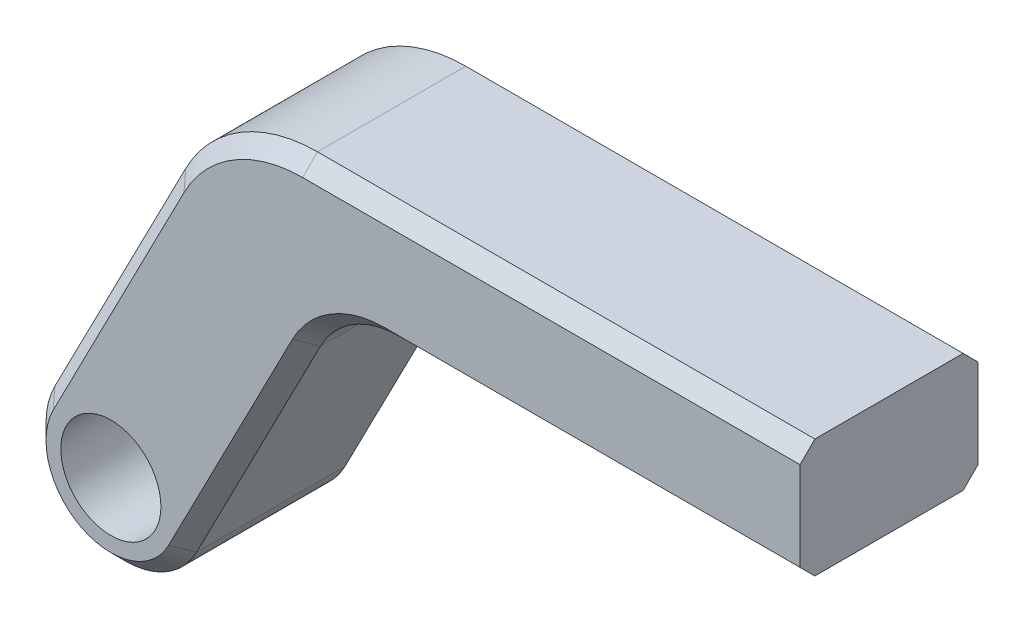
ISO-10303-21;
HEADER;
FILE_DESCRIPTION(('STEP AP214'),'2;1');
FILE_NAME('part.step','',(''),(''),'','','');
FILE_SCHEMA(('AUTOMOTIVE_DESIGN { 1 0 10303 214 1 1 1 1 }'));
ENDSEC;
DATA;
#1=APPLICATION_CONTEXT('core data for automotive mechanical design processes');
#2=APPLICATION_PROTOCOL_DEFINITION('international standard','automotive_design',2000,#1);
#3=PRODUCT_CONTEXT('',#1,'mechanical');
#4=PRODUCT('Part','Part','',(#3));
#5=PRODUCT_RELATED_PRODUCT_CATEGORY('part','',(#4));
#6=PRODUCT_DEFINITION_FORMATION('','',#4);
#7=PRODUCT_DEFINITION_CONTEXT('part definition',#1,'design');
#8=PRODUCT_DEFINITION('design','',#6,#7);
#9=PRODUCT_DEFINITION_SHAPE('','',#8);
#10=(LENGTH_UNIT() NAMED_UNIT(*) SI_UNIT(.MILLI.,.METRE.));
#11=(NAMED_UNIT(*) PLANE_ANGLE_UNIT() SI_UNIT($,.RADIAN.));
#12=(NAMED_UNIT(*) SI_UNIT($,.STERADIAN.) SOLID_ANGLE_UNIT());
#13=UNCERTAINTY_MEASURE_WITH_UNIT(LENGTH_MEASURE(1.E-05),#10,'distance_accuracy_value','');
#14=(GEOMETRIC_REPRESENTATION_CONTEXT(3) GLOBAL_UNCERTAINTY_ASSIGNED_CONTEXT((#13)) GLOBAL_UNIT_ASSIGNED_CONTEXT((#10,
#11,#12)) REPRESENTATION_CONTEXT('',''));
#15=CARTESIAN_POINT('',(0.,0.,0.));
#16=DIRECTION('',(0.,0.,1.));
#17=DIRECTION('',(1.,0.,0.));
#18=AXIS2_PLACEMENT_3D('',#15,#16,#17);
#19=CARTESIAN_POINT('',(-4.7779354520384,2.46210434712963,12.));
#20=DIRECTION('',(0.888918223635052,-0.458065925047372,0.));
#21=DIRECTION('',(0.458065925047372,0.888918223635052,0.));
#22=AXIS2_PLACEMENT_3D('',#19,#20,#21);
#23=PLANE('',#22);
#24=DIRECTION('',(0.,0.,-1.));
#25=VECTOR('',#24,1.);
#26=CARTESIAN_POINT('',(4.04337845376568,19.5806592504737,0.));
#27=LINE('',#26,#25);
#28=CARTESIAN_POINT('',(4.04337845376568,19.5806592504737,11.));
#29=VERTEX_POINT('',#28);
#30=CARTESIAN_POINT('',(4.04337845376568,19.5806592504737,1.));
#31=VERTEX_POINT('',#30);
#32=EDGE_CURVE('E336',#29,#31,#27,.T.);
#33=ORIENTED_EDGE('',*,*,#32,.T.);
#34=DIRECTION('',(-0.458065925047372,-0.888918223635052,0.));
#35=VECTOR('',#34,1.);
#36=CARTESIAN_POINT('',(-4.7779354520384,2.46210434712963,1.));
#37=LINE('',#36,#35);
#38=CARTESIAN_POINT('',(-4.7779354520384,2.46210434712962,1.));
#39=VERTEX_POINT('',#38);
#40=EDGE_CURVE('E218',#31,#39,#37,.T.);
#41=ORIENTED_EDGE('',*,*,#40,.T.);
#42=DIRECTION('',(0.,0.,-1.));
#43=VECTOR('',#42,1.);
#44=CARTESIAN_POINT('',(-4.7779354520384,2.46210434712962,12.));
#45=LINE('',#44,#43);
#46=CARTESIAN_POINT('',(-4.7779354520384,2.46210434712962,11.));
#47=VERTEX_POINT('',#46);
#48=EDGE_CURVE('E324',#47,#39,#45,.T.);
#49=ORIENTED_EDGE('',*,*,#48,.F.);
#50=DIRECTION('',(0.458065925047372,0.888918223635052,0.));
#51=VECTOR('',#50,1.);
#52=CARTESIAN_POINT('',(4.04337845376568,19.5806592504737,11.));
#53=LINE('',#52,#51);
#54=EDGE_CURVE('E215',#47,#29,#53,.T.);
#55=ORIENTED_EDGE('',*,*,#54,.T.);
#56=EDGE_LOOP('',(#33,#41,#49,#55));
#57=FACE_BOUND('',#56,.T.);
#58=ADVANCED_FACE('F43',(#57),#23,.F.);
#59=CARTESIAN_POINT('',(0.,0.,12.));
#60=DIRECTION('',(0.,0.,-1.));
#61=DIRECTION('',(-1.,0.,0.));
#62=AXIS2_PLACEMENT_3D('',#59,#60,#61);
#63=CYLINDRICAL_SURFACE('',#62,5.375);
#64=ORIENTED_EDGE('',*,*,#48,.T.);
#65=CARTESIAN_POINT('',(0.,0.,1.));
#66=DIRECTION('',(0.,0.,1.));
#67=DIRECTION('',(1.,0.,0.));
#68=AXIS2_PLACEMENT_3D('',#65,#66,#67);
#69=CIRCLE('',#68,5.375);
#70=CARTESIAN_POINT('',(4.7779354520384,-2.46210434712962,1.));
#71=VERTEX_POINT('',#70);
#72=EDGE_CURVE('E212',#39,#71,#69,.T.);
#73=ORIENTED_EDGE('',*,*,#72,.T.);
#74=DIRECTION('',(0.,0.,-1.));
#75=VECTOR('',#74,1.);
#76=CARTESIAN_POINT('',(4.7779354520384,-2.46210434712962,12.));
#77=LINE('',#76,#75);
#78=CARTESIAN_POINT('',(4.7779354520384,-2.46210434712962,11.));
#79=VERTEX_POINT('',#78);
#80=EDGE_CURVE('E314',#79,#71,#77,.T.);
#81=ORIENTED_EDGE('',*,*,#80,.F.);
#82=CARTESIAN_POINT('',(0.,0.,11.));
#83=DIRECTION('',(0.,0.,1.));
#84=DIRECTION('',(1.,0.,0.));
#85=AXIS2_PLACEMENT_3D('',#82,#83,#84);
#86=CIRCLE('',#85,5.375);
#87=EDGE_CURVE('E209',#79,#47,#86,.F.);
#88=ORIENTED_EDGE('',*,*,#87,.T.);
#89=EDGE_LOOP('',(#64,#73,#81,#88));
#90=FACE_BOUND('',#89,.T.);
#91=ADVANCED_FACE('F423',(#90),#63,.T.);
#92=CARTESIAN_POINT('',(4.7779354520384,-2.46210434712962,12.));
#93=DIRECTION('',(0.888918223635051,-0.458065925047372,0.));
#94=DIRECTION('',(0.458065925047372,0.888918223635052,0.));
#95=AXIS2_PLACEMENT_3D('',#92,#93,#94);
#96=PLANE('',#95);
#97=ORIENTED_EDGE('',*,*,#80,.T.);
#98=DIRECTION('',(0.458065925047372,0.888918223635052,0.));
#99=VECTOR('',#98,1.);
#100=CARTESIAN_POINT('',(13.1313221118643,13.7483955502842,1.));
#101=LINE('',#100,#99);
#102=CARTESIAN_POINT('',(13.1313221118643,13.7483955502842,1.));
#103=VERTEX_POINT('',#102);
#104=EDGE_CURVE('E206',#71,#103,#101,.T.);
#105=ORIENTED_EDGE('',*,*,#104,.T.);
#106=DIRECTION('',(0.,0.,-1.));
#107=VECTOR('',#106,1.);
#108=CARTESIAN_POINT('',(13.1313221118643,13.7483955502842,12.));
#109=LINE('',#108,#107);
#110=CARTESIAN_POINT('',(13.1313221118643,13.7483955502842,11.));
#111=VERTEX_POINT('',#110);
#112=EDGE_CURVE('E332',#103,#111,#109,.F.);
#113=ORIENTED_EDGE('',*,*,#112,.T.);
#114=DIRECTION('',(-0.458065925047372,-0.888918223635052,0.));
#115=VECTOR('',#114,1.);
#116=CARTESIAN_POINT('',(4.7779354520384,-2.46210434712962,11.));
#117=LINE('',#116,#115);
#118=EDGE_CURVE('E203',#111,#79,#117,.T.);
#119=ORIENTED_EDGE('',*,*,#118,.T.);
#120=EDGE_LOOP('',(#97,#105,#113,#119));
#121=FACE_BOUND('',#120,.T.);
#122=ADVANCED_FACE('F393',(#121),#96,.T.);
#123=CARTESIAN_POINT('',(0.,17.,12.));
#124=DIRECTION('',(0.,-1.,0.));
#125=DIRECTION('',(1.,0.,0.));
#126=AXIS2_PLACEMENT_3D('',#123,#124,#125);
#127=PLANE('',#126);
#128=DIRECTION('',(0.,0.,-1.));
#129=VECTOR('',#128,1.);
#130=CARTESIAN_POINT('',(18.4648314536746,17.,0.));
#131=LINE('',#130,#129);
#132=CARTESIAN_POINT('',(18.4648314536746,17.,11.));
#133=VERTEX_POINT('',#132);
#134=CARTESIAN_POINT('',(18.4648314536746,17.,1.));
#135=VERTEX_POINT('',#134);
#136=EDGE_CURVE('E328',#133,#135,#131,.T.);
#137=ORIENTED_EDGE('',*,*,#136,.T.);
#138=DIRECTION('',(1.,0.,0.));
#139=VECTOR('',#138,1.);
#140=CARTESIAN_POINT('',(46.4739345166854,17.,1.));
#141=LINE('',#140,#139);
#142=CARTESIAN_POINT('',(46.4739345166854,17.,1.));
#143=VERTEX_POINT('',#142);
#144=EDGE_CURVE('E363',#135,#143,#141,.T.);
#145=ORIENTED_EDGE('',*,*,#144,.T.);
#146=DIRECTION('',(0.,0.,-1.));
#147=VECTOR('',#146,1.);
#148=CARTESIAN_POINT('',(46.4739345166854,17.,12.));
#149=LINE('',#148,#147);
#150=CARTESIAN_POINT('',(46.4739345166854,17.,11.));
#151=VERTEX_POINT('',#150);
#152=EDGE_CURVE('E309',#151,#143,#149,.T.);
#153=ORIENTED_EDGE('',*,*,#152,.F.);
#154=DIRECTION('',(-1.,0.,0.));
#155=VECTOR('',#154,1.);
#156=CARTESIAN_POINT('',(0.,17.,11.));
#157=LINE('',#156,#155);
#158=EDGE_CURVE('E359',#151,#133,#157,.T.);
#159=ORIENTED_EDGE('',*,*,#158,.T.);
#160=EDGE_LOOP('',(#137,#145,#153,#159));
#161=FACE_BOUND('',#160,.T.);
#162=ADVANCED_FACE('F369',(#161),#127,.T.);
#163=CARTESIAN_POINT('',(46.4739345166854,0.,12.));
#164=DIRECTION('',(1.,0.,0.));
#165=DIRECTION('',(0.,0.,-1.));
#166=AXIS2_PLACEMENT_3D('',#163,#164,#165);
#167=PLANE('',#166);
#168=ORIENTED_EDGE('',*,*,#152,.T.);
#169=DIRECTION('',(0.,0.707106781186548,-0.707106781186548));
#170=VECTOR('',#169,1.);
#171=CARTESIAN_POINT('',(46.4739345166854,3.,15.));
#172=LINE('',#171,#170);
#173=CARTESIAN_POINT('',(46.4739345166854,18.,0.));
#174=VERTEX_POINT('',#173);
#175=EDGE_CURVE('E179',#143,#174,#172,.T.);
#176=ORIENTED_EDGE('',*,*,#175,.T.);
#177=DIRECTION('',(0.,-1.,0.));
#178=VECTOR('',#177,1.);
#179=CARTESIAN_POINT('',(46.4739345166854,0.,0.));
#180=LINE('',#179,#178);
#181=CARTESIAN_POINT('',(46.4739345166854,24.,0.));
#182=VERTEX_POINT('',#181);
#183=EDGE_CURVE('E161',#182,#174,#180,.T.);
#184=ORIENTED_EDGE('',*,*,#183,.F.);
#185=DIRECTION('',(0.,0.707106781186548,0.707106781186548));
#186=VECTOR('',#185,1.);
#187=CARTESIAN_POINT('',(46.4739345166854,18.,-6.));
#188=LINE('',#187,#186);
#189=CARTESIAN_POINT('',(46.4739345166854,25.,1.));
#190=VERTEX_POINT('',#189);
#191=EDGE_CURVE('E176',#182,#190,#188,.T.);
#192=ORIENTED_EDGE('',*,*,#191,.T.);
#193=DIRECTION('',(0.,0.,-1.));
#194=VECTOR('',#193,1.);
#195=CARTESIAN_POINT('',(46.4739345166854,25.,12.));
#196=LINE('',#195,#194);
#197=CARTESIAN_POINT('',(46.4739345166854,25.,11.));
#198=VERTEX_POINT('',#197);
#199=EDGE_CURVE('E304',#198,#190,#196,.T.);
#200=ORIENTED_EDGE('',*,*,#199,.F.);
#201=DIRECTION('',(0.,0.707106781186548,-0.707106781186548));
#202=VECTOR('',#201,1.);
#203=CARTESIAN_POINT('',(46.4739345166854,12.,24.));
#204=LINE('',#203,#202);
#205=CARTESIAN_POINT('',(46.4739345166854,24.,12.));
#206=VERTEX_POINT('',#205);
#207=EDGE_CURVE('E194',#198,#206,#204,.F.);
#208=ORIENTED_EDGE('',*,*,#207,.T.);
#209=DIRECTION('',(0.,-1.,0.));
#210=VECTOR('',#209,1.);
#211=CARTESIAN_POINT('',(46.4739345166854,0.,12.));
#212=LINE('',#211,#210);
#213=CARTESIAN_POINT('',(46.4739345166854,18.,12.));
#214=VERTEX_POINT('',#213);
#215=EDGE_CURVE('E317',#206,#214,#212,.T.);
#216=ORIENTED_EDGE('',*,*,#215,.T.);
#217=DIRECTION('',(0.,0.707106781186548,0.707106781186548));
#218=VECTOR('',#217,1.);
#219=CARTESIAN_POINT('',(46.4739345166854,9.00000000000001,2.99999999999999));
#220=LINE('',#219,#218);
#221=EDGE_CURVE('E188',#214,#151,#220,.F.);
#222=ORIENTED_EDGE('',*,*,#221,.T.);
#223=EDGE_LOOP('',(#168,#176,#184,#192,#200,#208,#216,#222));
#224=FACE_BOUND('',#223,.T.);
#225=ADVANCED_FACE('F174',(#224),#167,.T.);
#226=CARTESIAN_POINT('',(0.,25.,12.));
#227=DIRECTION('',(0.,1.,0.));
#228=DIRECTION('',(0.,0.,1.));
#229=AXIS2_PLACEMENT_3D('',#226,#227,#228);
#230=PLANE('',#229);
#231=ORIENTED_EDGE('',*,*,#199,.T.);
#232=DIRECTION('',(-1.,0.,0.));
#233=VECTOR('',#232,1.);
#234=CARTESIAN_POINT('',(12.9325606901162,25.,1.));
#235=LINE('',#234,#233);
#236=CARTESIAN_POINT('',(12.9325606901162,25.,1.));
#237=VERTEX_POINT('',#236);
#238=EDGE_CURVE('E186',#190,#237,#235,.T.);
#239=ORIENTED_EDGE('',*,*,#238,.T.);
#240=DIRECTION('',(0.,0.,-1.));
#241=VECTOR('',#240,1.);
#242=CARTESIAN_POINT('',(12.9325606901162,25.,12.));
#243=LINE('',#242,#241);
#244=CARTESIAN_POINT('',(12.9325606901162,25.,11.));
#245=VERTEX_POINT('',#244);
#246=EDGE_CURVE('E170',#237,#245,#243,.F.);
#247=ORIENTED_EDGE('',*,*,#246,.T.);
#248=DIRECTION('',(1.,0.,0.));
#249=VECTOR('',#248,1.);
#250=CARTESIAN_POINT('',(0.,25.,11.));
#251=LINE('',#250,#249);
#252=EDGE_CURVE('E227',#245,#198,#251,.T.);
#253=ORIENTED_EDGE('',*,*,#252,.T.);
#254=EDGE_LOOP('',(#231,#239,#247,#253));
#255=FACE_BOUND('',#254,.T.);
#256=ADVANCED_FACE('F303',(#255),#230,.T.);
#257=CARTESIAN_POINT('',(0.,0.,12.));
#258=DIRECTION('',(0.,0.,-1.));
#259=DIRECTION('',(-1.,0.,0.));
#260=AXIS2_PLACEMENT_3D('',#257,#258,#259);
#261=CYLINDRICAL_SURFACE('',#260,3.375);
#262=CARTESIAN_POINT('',(0.,0.,12.));
#263=DIRECTION('',(0.,0.,1.));
#264=DIRECTION('',(1.,0.,0.));
#265=AXIS2_PLACEMENT_3D('',#262,#263,#264);
#266=CIRCLE('',#265,3.375);
#267=CARTESIAN_POINT('',(3.375,0.,12.));
#268=VERTEX_POINT('',#267);
#269=EDGE_CURVE('E310',#268,#268,#266,.T.);
#270=ORIENTED_EDGE('',*,*,#269,.T.);
#271=EDGE_LOOP('',(#270));
#272=FACE_BOUND('',#271,.T.);
#273=CARTESIAN_POINT('',(0.,0.,0.));
#274=DIRECTION('',(0.,0.,1.));
#275=DIRECTION('',(1.,0.,0.));
#276=AXIS2_PLACEMENT_3D('',#273,#274,#275);
#277=CIRCLE('',#276,3.375);
#278=CARTESIAN_POINT('',(3.375,0.,0.));
#279=VERTEX_POINT('',#278);
#280=EDGE_CURVE('E181',#279,#279,#277,.T.);
#281=ORIENTED_EDGE('',*,*,#280,.F.);
#282=EDGE_LOOP('',(#281));
#283=FACE_BOUND('',#282,.T.);
#284=ADVANCED_FACE('F411',(#272,#283),#261,.F.);
#285=CARTESIAN_POINT('',(0.,0.,12.));
#286=DIRECTION('',(0.,0.,1.));
#287=DIRECTION('',(1.,0.,0.));
#288=AXIS2_PLACEMENT_3D('',#285,#286,#287);
#289=PLANE('',#288);
#290=CARTESIAN_POINT('',(18.4648314536746,11.,12.));
#291=DIRECTION('',(0.,0.,1.));
#292=DIRECTION('',(1.,0.,0.));
#293=AXIS2_PLACEMENT_3D('',#290,#291,#292);
#294=CIRCLE('',#293,7.00000000000001);
#295=CARTESIAN_POINT('',(12.2424038882293,14.2064614753316,12.));
#296=VERTEX_POINT('',#295);
#297=CARTESIAN_POINT('',(18.4648314536746,18.,12.));
#298=VERTEX_POINT('',#297);
#299=EDGE_CURVE('E53',#296,#298,#294,.F.);
#300=ORIENTED_EDGE('',*,*,#299,.T.);
#301=DIRECTION('',(1.,0.,0.));
#302=VECTOR('',#301,1.);
#303=CARTESIAN_POINT('',(0.,18.,12.));
#304=LINE('',#303,#302);
#305=EDGE_CURVE('E12',#298,#214,#304,.T.);
#306=ORIENTED_EDGE('',*,*,#305,.T.);
#307=ORIENTED_EDGE('',*,*,#215,.F.);
#308=DIRECTION('',(-1.,0.,0.));
#309=VECTOR('',#308,1.);
#310=CARTESIAN_POINT('',(0.,24.,12.));
#311=LINE('',#310,#309);
#312=CARTESIAN_POINT('',(12.9325606901162,24.,12.));
#313=VERTEX_POINT('',#312);
#314=EDGE_CURVE('E232',#206,#313,#311,.T.);
#315=ORIENTED_EDGE('',*,*,#314,.T.);
#316=CARTESIAN_POINT('',(12.9325606901162,15.,12.));
#317=DIRECTION('',(0.,0.,1.));
#318=DIRECTION('',(1.,0.,0.));
#319=AXIS2_PLACEMENT_3D('',#316,#317,#318);
#320=CIRCLE('',#319,8.99999999999999);
#321=CARTESIAN_POINT('',(4.93229667740073,19.1225933254263,12.));
#322=VERTEX_POINT('',#321);
#323=EDGE_CURVE('E235',#313,#322,#320,.T.);
#324=ORIENTED_EDGE('',*,*,#323,.T.);
#325=DIRECTION('',(-0.458065925047372,-0.888918223635051,0.));
#326=VECTOR('',#325,1.);
#327=CARTESIAN_POINT('',(-3.88901722840334,2.00403842208225,12.));
#328=LINE('',#327,#326);
#329=CARTESIAN_POINT('',(-3.88901722840334,2.00403842208225,12.));
#330=VERTEX_POINT('',#329);
#331=EDGE_CURVE('E238',#322,#330,#328,.T.);
#332=ORIENTED_EDGE('',*,*,#331,.T.);
#333=CARTESIAN_POINT('',(0.,0.,12.));
#334=DIRECTION('',(0.,0.,1.));
#335=DIRECTION('',(1.,0.,0.));
#336=AXIS2_PLACEMENT_3D('',#333,#334,#335);
#337=CIRCLE('',#336,4.37499999999999);
#338=CARTESIAN_POINT('',(3.88901722840334,-2.00403842208225,12.));
#339=VERTEX_POINT('',#338);
#340=EDGE_CURVE('E241',#330,#339,#337,.T.);
#341=ORIENTED_EDGE('',*,*,#340,.T.);
#342=DIRECTION('',(0.458065925047372,0.888918223635052,0.));
#343=VECTOR('',#342,1.);
#344=CARTESIAN_POINT('',(3.88901722840335,-2.00403842208225,12.));
#345=LINE('',#344,#343);
#346=EDGE_CURVE('E64',#339,#296,#345,.T.);
#347=ORIENTED_EDGE('',*,*,#346,.T.);
#348=EDGE_LOOP('',(#300,#306,#307,#315,#324,#332,#341,#347));
#349=FACE_BOUND('',#348,.T.);
#350=ORIENTED_EDGE('',*,*,#269,.F.);
#351=EDGE_LOOP('',(#350));
#352=FACE_BOUND('',#351,.T.);
#353=ADVANCED_FACE('F403',(#349,#352),#289,.T.);
#354=CARTESIAN_POINT('',(0.,0.,0.));
#355=DIRECTION('',(0.,0.,1.));
#356=DIRECTION('',(1.,0.,0.));
#357=AXIS2_PLACEMENT_3D('',#354,#355,#356);
#358=PLANE('',#357);
#359=ORIENTED_EDGE('',*,*,#183,.T.);
#360=DIRECTION('',(-1.,0.,0.));
#361=VECTOR('',#360,1.);
#362=CARTESIAN_POINT('',(18.4648314536746,18.,0.));
#363=LINE('',#362,#361);
#364=CARTESIAN_POINT('',(18.4648314536746,18.,0.));
#365=VERTEX_POINT('',#364);
#366=EDGE_CURVE('E356',#174,#365,#363,.T.);
#367=ORIENTED_EDGE('',*,*,#366,.T.);
#368=CARTESIAN_POINT('',(18.4648314536746,11.,0.));
#369=DIRECTION('',(0.,0.,1.));
#370=DIRECTION('',(1.,0.,0.));
#371=AXIS2_PLACEMENT_3D('',#368,#369,#370);
#372=CIRCLE('',#371,7.);
#373=CARTESIAN_POINT('',(12.2424038882293,14.2064614753316,0.));
#374=VERTEX_POINT('',#373);
#375=EDGE_CURVE('E353',#365,#374,#372,.T.);
#376=ORIENTED_EDGE('',*,*,#375,.T.);
#377=DIRECTION('',(-0.458065925047372,-0.888918223635052,0.));
#378=VECTOR('',#377,1.);
#379=CARTESIAN_POINT('',(3.88901722840335,-2.00403842208225,0.));
#380=LINE('',#379,#378);
#381=CARTESIAN_POINT('',(3.88901722840335,-2.00403842208225,0.));
#382=VERTEX_POINT('',#381);
#383=EDGE_CURVE('E350',#374,#382,#380,.T.);
#384=ORIENTED_EDGE('',*,*,#383,.T.);
#385=CARTESIAN_POINT('',(0.,0.,0.));
#386=DIRECTION('',(0.,0.,1.));
#387=DIRECTION('',(1.,0.,0.));
#388=AXIS2_PLACEMENT_3D('',#385,#386,#387);
#389=CIRCLE('',#388,4.375);
#390=CARTESIAN_POINT('',(-3.88901722840335,2.00403842208225,0.));
#391=VERTEX_POINT('',#390);
#392=EDGE_CURVE('E347',#382,#391,#389,.F.);
#393=ORIENTED_EDGE('',*,*,#392,.T.);
#394=DIRECTION('',(0.458065925047372,0.888918223635051,0.));
#395=VECTOR('',#394,1.);
#396=CARTESIAN_POINT('',(-3.88901722840335,2.00403842208225,0.));
#397=LINE('',#396,#395);
#398=CARTESIAN_POINT('',(4.93229667740073,19.1225933254264,0.));
#399=VERTEX_POINT('',#398);
#400=EDGE_CURVE('E344',#391,#399,#397,.T.);
#401=ORIENTED_EDGE('',*,*,#400,.T.);
#402=CARTESIAN_POINT('',(12.9325606901162,15.,0.));
#403=DIRECTION('',(0.,0.,1.));
#404=DIRECTION('',(1.,0.,0.));
#405=AXIS2_PLACEMENT_3D('',#402,#403,#404);
#406=CIRCLE('',#405,9.);
#407=CARTESIAN_POINT('',(12.9325606901162,24.,0.));
#408=VERTEX_POINT('',#407);
#409=EDGE_CURVE('E164',#399,#408,#406,.F.);
#410=ORIENTED_EDGE('',*,*,#409,.T.);
#411=DIRECTION('',(1.,0.,0.));
#412=VECTOR('',#411,1.);
#413=CARTESIAN_POINT('',(46.4739345166854,24.,0.));
#414=LINE('',#413,#412);
#415=EDGE_CURVE('E156',#408,#182,#414,.T.);
#416=ORIENTED_EDGE('',*,*,#415,.T.);
#417=EDGE_LOOP('',(#359,#367,#376,#384,#393,#401,#410,#416));
#418=FACE_BOUND('',#417,.T.);
#419=ORIENTED_EDGE('',*,*,#280,.T.);
#420=EDGE_LOOP('',(#419));
#421=FACE_BOUND('',#420,.T.);
#422=ADVANCED_FACE('F158',(#418,#421),#358,.F.);
#423=CARTESIAN_POINT('',(18.4648314536746,11.,12.));
#424=DIRECTION('',(0.,0.,1.));
#425=DIRECTION('',(1.,0.,0.));
#426=AXIS2_PLACEMENT_3D('',#423,#424,#425);
#427=CYLINDRICAL_SURFACE('',#426,6.);
#428=ORIENTED_EDGE('',*,*,#112,.F.);
#429=CARTESIAN_POINT('',(18.4648314536746,11.,1.));
#430=DIRECTION('',(0.,0.,1.));
#431=DIRECTION('',(1.,0.,0.));
#432=AXIS2_PLACEMENT_3D('',#429,#430,#431);
#433=CIRCLE('',#432,6.);
#434=EDGE_CURVE('E200',#103,#135,#433,.F.);
#435=ORIENTED_EDGE('',*,*,#434,.T.);
#436=ORIENTED_EDGE('',*,*,#136,.F.);
#437=CARTESIAN_POINT('',(18.4648314536746,11.,11.));
#438=DIRECTION('',(0.,0.,1.));
#439=DIRECTION('',(1.,0.,0.));
#440=AXIS2_PLACEMENT_3D('',#437,#438,#439);
#441=CIRCLE('',#440,6.);
#442=EDGE_CURVE('E192',#133,#111,#441,.T.);
#443=ORIENTED_EDGE('',*,*,#442,.T.);
#444=EDGE_LOOP('',(#428,#435,#436,#443));
#445=FACE_BOUND('',#444,.T.);
#446=ADVANCED_FACE('F389',(#445),#427,.F.);
#447=CARTESIAN_POINT('',(12.9325606901162,15.,12.));
#448=DIRECTION('',(0.,0.,1.));
#449=DIRECTION('',(1.,0.,0.));
#450=AXIS2_PLACEMENT_3D('',#447,#448,#449);
#451=CYLINDRICAL_SURFACE('',#450,10.);
#452=ORIENTED_EDGE('',*,*,#246,.F.);
#453=CARTESIAN_POINT('',(12.9325606901162,15.,1.));
#454=DIRECTION('',(0.,0.,1.));
#455=DIRECTION('',(1.,0.,0.));
#456=AXIS2_PLACEMENT_3D('',#453,#454,#455);
#457=CIRCLE('',#456,10.);
#458=EDGE_CURVE('E224',#237,#31,#457,.T.);
#459=ORIENTED_EDGE('',*,*,#458,.T.);
#460=ORIENTED_EDGE('',*,*,#32,.F.);
#461=CARTESIAN_POINT('',(12.9325606901162,15.,11.));
#462=DIRECTION('',(0.,0.,1.));
#463=DIRECTION('',(1.,0.,0.));
#464=AXIS2_PLACEMENT_3D('',#461,#462,#463);
#465=CIRCLE('',#464,10.);
#466=EDGE_CURVE('E221',#29,#245,#465,.F.);
#467=ORIENTED_EDGE('',*,*,#466,.T.);
#468=EDGE_LOOP('',(#452,#459,#460,#467));
#469=FACE_BOUND('',#468,.T.);
#470=ADVANCED_FACE('F435',(#469),#451,.T.);
#471=CARTESIAN_POINT('',(0.,24.,0.));
#472=DIRECTION('',(0.,0.707106781186547,-0.707106781186547));
#473=DIRECTION('',(-1.,0.,0.));
#474=AXIS2_PLACEMENT_3D('',#471,#472,#473);
#475=PLANE('',#474);
#476=ORIENTED_EDGE('',*,*,#191,.F.);
#477=ORIENTED_EDGE('',*,*,#415,.F.);
#478=DIRECTION('',(0.,-0.707106781186547,-0.707106781186547));
#479=VECTOR('',#478,1.);
#480=CARTESIAN_POINT('',(12.9325606901162,25.,1.));
#481=LINE('',#480,#479);
#482=EDGE_CURVE('E182',#237,#408,#481,.T.);
#483=ORIENTED_EDGE('',*,*,#482,.F.);
#484=ORIENTED_EDGE('',*,*,#238,.F.);
#485=EDGE_LOOP('',(#476,#477,#483,#484));
#486=FACE_BOUND('',#485,.T.);
#487=ADVANCED_FACE('F185',(#486),#475,.T.);
#488=CARTESIAN_POINT('',(12.9325606901162,15.,0.));
#489=DIRECTION('',(0.,0.,1.));
#490=DIRECTION('',(1.,0.,0.));
#491=AXIS2_PLACEMENT_3D('',#488,#489,#490);
#492=CONICAL_SURFACE('',#491,9.,0.785398163397447);
#493=ORIENTED_EDGE('',*,*,#482,.T.);
#494=ORIENTED_EDGE('',*,*,#409,.F.);
#495=DIRECTION('',(0.628560103852644,-0.323901521831486,-0.707106781186548));
#496=VECTOR('',#495,1.);
#497=CARTESIAN_POINT('',(4.04337845376568,19.5806592504737,1.));
#498=LINE('',#497,#496);
#499=EDGE_CURVE('E263',#31,#399,#498,.T.);
#500=ORIENTED_EDGE('',*,*,#499,.F.);
#501=ORIENTED_EDGE('',*,*,#458,.F.);
#502=EDGE_LOOP('',(#493,#494,#500,#501));
#503=FACE_BOUND('',#502,.T.);
#504=ADVANCED_FACE('F452',(#503),#492,.T.);
#505=CARTESIAN_POINT('',(-4.7779354520384,2.46210434712963,1.));
#506=DIRECTION('',(0.628560103852644,-0.323901521831485,0.707106781186548));
#507=DIRECTION('',(-0.458065925047372,-0.888918223635052,0.));
#508=AXIS2_PLACEMENT_3D('',#505,#506,#507);
#509=PLANE('',#508);
#510=ORIENTED_EDGE('',*,*,#499,.T.);
#511=ORIENTED_EDGE('',*,*,#400,.F.);
#512=DIRECTION('',(0.628560103852645,-0.323901521831486,-0.707106781186547));
#513=VECTOR('',#512,1.);
#514=CARTESIAN_POINT('',(-4.7779354520384,2.46210434712963,1.));
#515=LINE('',#514,#513);
#516=EDGE_CURVE('E259',#39,#391,#515,.T.);
#517=ORIENTED_EDGE('',*,*,#516,.F.);
#518=ORIENTED_EDGE('',*,*,#40,.F.);
#519=EDGE_LOOP('',(#510,#511,#517,#518));
#520=FACE_BOUND('',#519,.T.);
#521=ADVANCED_FACE('F448',(#520),#509,.F.);
#522=CARTESIAN_POINT('',(0.,0.,1.));
#523=DIRECTION('',(0.,0.,1.));
#524=DIRECTION('',(1.,0.,0.));
#525=AXIS2_PLACEMENT_3D('',#522,#523,#524);
#526=CONICAL_SURFACE('',#525,5.375,0.785398163397448);
#527=ORIENTED_EDGE('',*,*,#516,.T.);
#528=ORIENTED_EDGE('',*,*,#392,.F.);
#529=DIRECTION('',(-0.628560103852645,0.323901521831485,-0.707106781186548));
#530=VECTOR('',#529,1.);
#531=CARTESIAN_POINT('',(4.7779354520384,-2.46210434712962,1.));
#532=LINE('',#531,#530);
#533=EDGE_CURVE('E255',#71,#382,#532,.T.);
#534=ORIENTED_EDGE('',*,*,#533,.F.);
#535=ORIENTED_EDGE('',*,*,#72,.F.);
#536=EDGE_LOOP('',(#527,#528,#534,#535));
#537=FACE_BOUND('',#536,.T.);
#538=ADVANCED_FACE('F445',(#537),#526,.T.);
#539=CARTESIAN_POINT('',(3.88901722840335,-2.00403842208225,0.));
#540=DIRECTION('',(0.628560103852645,-0.323901521831485,-0.707106781186548));
#541=DIRECTION('',(0.458065925047372,0.888918223635052,0.));
#542=AXIS2_PLACEMENT_3D('',#539,#540,#541);
#543=PLANE('',#542);
#544=ORIENTED_EDGE('',*,*,#533,.T.);
#545=ORIENTED_EDGE('',*,*,#383,.F.);
#546=DIRECTION('',(-0.628560103852644,0.323901521831485,-0.707106781186548));
#547=VECTOR('',#546,1.);
#548=CARTESIAN_POINT('',(13.1313221118643,13.7483955502842,1.));
#549=LINE('',#548,#547);
#550=EDGE_CURVE('E251',#103,#374,#549,.T.);
#551=ORIENTED_EDGE('',*,*,#550,.F.);
#552=ORIENTED_EDGE('',*,*,#104,.F.);
#553=EDGE_LOOP('',(#544,#545,#551,#552));
#554=FACE_BOUND('',#553,.T.);
#555=ADVANCED_FACE('F382',(#554),#543,.T.);
#556=CARTESIAN_POINT('',(18.4648314536746,11.,0.));
#557=DIRECTION('',(0.,0.,-1.));
#558=DIRECTION('',(-1.,0.,0.));
#559=AXIS2_PLACEMENT_3D('',#556,#557,#558);
#560=CONICAL_SURFACE('',#559,7.,0.785398163397448);
#561=ORIENTED_EDGE('',*,*,#550,.T.);
#562=ORIENTED_EDGE('',*,*,#375,.F.);
#563=DIRECTION('',(0.,0.707106781186547,-0.707106781186547));
#564=VECTOR('',#563,1.);
#565=CARTESIAN_POINT('',(18.4648314536746,17.,1.));
#566=LINE('',#565,#564);
#567=EDGE_CURVE('E248',#135,#365,#566,.T.);
#568=ORIENTED_EDGE('',*,*,#567,.F.);
#569=ORIENTED_EDGE('',*,*,#434,.F.);
#570=EDGE_LOOP('',(#561,#562,#568,#569));
#571=FACE_BOUND('',#570,.T.);
#572=ADVANCED_FACE('F386',(#571),#560,.F.);
#573=CARTESIAN_POINT('',(0.,18.,0.));
#574=DIRECTION('',(0.,-0.707106781186547,-0.707106781186547));
#575=DIRECTION('',(1.,0.,0.));
#576=AXIS2_PLACEMENT_3D('',#573,#574,#575);
#577=PLANE('',#576);
#578=ORIENTED_EDGE('',*,*,#175,.F.);
#579=ORIENTED_EDGE('',*,*,#144,.F.);
#580=ORIENTED_EDGE('',*,*,#567,.T.);
#581=ORIENTED_EDGE('',*,*,#366,.F.);
#582=EDGE_LOOP('',(#578,#579,#580,#581));
#583=FACE_BOUND('',#582,.T.);
#584=ADVANCED_FACE('F375',(#583),#577,.T.);
#585=CARTESIAN_POINT('',(0.,25.,11.));
#586=DIRECTION('',(0.,-0.707106781186547,-0.707106781186547));
#587=DIRECTION('',(1.,0.,0.));
#588=AXIS2_PLACEMENT_3D('',#585,#586,#587);
#589=PLANE('',#588);
#590=ORIENTED_EDGE('',*,*,#207,.F.);
#591=ORIENTED_EDGE('',*,*,#252,.F.);
#592=DIRECTION('',(0.,0.707106781186547,-0.707106781186547));
#593=VECTOR('',#592,1.);
#594=CARTESIAN_POINT('',(12.9325606901162,24.,12.));
#595=LINE('',#594,#593);
#596=EDGE_CURVE('E47',#313,#245,#595,.T.);
#597=ORIENTED_EDGE('',*,*,#596,.F.);
#598=ORIENTED_EDGE('',*,*,#314,.F.);
#599=EDGE_LOOP('',(#590,#591,#597,#598));
#600=FACE_BOUND('',#599,.T.);
#601=ADVANCED_FACE('F45',(#600),#589,.F.);
#602=CARTESIAN_POINT('',(12.9325606901162,15.,12.));
#603=DIRECTION('',(0.,0.,-1.));
#604=DIRECTION('',(-1.,0.,0.));
#605=AXIS2_PLACEMENT_3D('',#602,#603,#604);
#606=CONICAL_SURFACE('',#605,8.99999999999999,0.785398163397447);
#607=ORIENTED_EDGE('',*,*,#596,.T.);
#608=ORIENTED_EDGE('',*,*,#466,.F.);
#609=DIRECTION('',(-0.628560103852644,0.323901521831486,-0.707106781186548));
#610=VECTOR('',#609,1.);
#611=CARTESIAN_POINT('',(4.93229667740073,19.1225933254263,12.));
#612=LINE('',#611,#610);
#613=EDGE_CURVE('E283',#322,#29,#612,.T.);
#614=ORIENTED_EDGE('',*,*,#613,.F.);
#615=ORIENTED_EDGE('',*,*,#323,.F.);
#616=EDGE_LOOP('',(#607,#608,#614,#615));
#617=FACE_BOUND('',#616,.T.);
#618=ADVANCED_FACE('F296',(#617),#606,.T.);
#619=CARTESIAN_POINT('',(-3.88901722840334,2.00403842208225,12.));
#620=DIRECTION('',(-0.628560103852645,0.323901521831486,0.707106781186548));
#621=DIRECTION('',(0.458065925047372,0.888918223635052,0.));
#622=AXIS2_PLACEMENT_3D('',#619,#620,#621);
#623=PLANE('',#622);
#624=ORIENTED_EDGE('',*,*,#613,.T.);
#625=ORIENTED_EDGE('',*,*,#54,.F.);
#626=DIRECTION('',(-0.628560103852644,0.323901521831485,-0.707106781186548));
#627=VECTOR('',#626,1.);
#628=CARTESIAN_POINT('',(-3.88901722840334,2.00403842208225,12.));
#629=LINE('',#628,#627);
#630=EDGE_CURVE('E280',#330,#47,#629,.T.);
#631=ORIENTED_EDGE('',*,*,#630,.F.);
#632=ORIENTED_EDGE('',*,*,#331,.F.);
#633=EDGE_LOOP('',(#624,#625,#631,#632));
#634=FACE_BOUND('',#633,.T.);
#635=ADVANCED_FACE('F468',(#634),#623,.T.);
#636=CARTESIAN_POINT('',(0.,0.,12.));
#637=DIRECTION('',(0.,0.,-1.));
#638=DIRECTION('',(-1.,0.,0.));
#639=AXIS2_PLACEMENT_3D('',#636,#637,#638);
#640=CONICAL_SURFACE('',#639,4.37499999999999,0.785398163397448);
#641=ORIENTED_EDGE('',*,*,#630,.T.);
#642=ORIENTED_EDGE('',*,*,#87,.F.);
#643=DIRECTION('',(0.628560103852645,-0.323901521831485,-0.707106781186548));
#644=VECTOR('',#643,1.);
#645=CARTESIAN_POINT('',(3.88901722840334,-2.00403842208225,12.));
#646=LINE('',#645,#644);
#647=EDGE_CURVE('E276',#339,#79,#646,.T.);
#648=ORIENTED_EDGE('',*,*,#647,.F.);
#649=ORIENTED_EDGE('',*,*,#340,.F.);
#650=EDGE_LOOP('',(#641,#642,#648,#649));
#651=FACE_BOUND('',#650,.T.);
#652=ADVANCED_FACE('F465',(#651),#640,.T.);
#653=CARTESIAN_POINT('',(4.7779354520384,-2.46210434712962,11.));
#654=DIRECTION('',(-0.628560103852645,0.323901521831486,-0.707106781186547));
#655=DIRECTION('',(-0.458065925047372,-0.888918223635052,0.));
#656=AXIS2_PLACEMENT_3D('',#653,#654,#655);
#657=PLANE('',#656);
#658=ORIENTED_EDGE('',*,*,#647,.T.);
#659=ORIENTED_EDGE('',*,*,#118,.F.);
#660=DIRECTION('',(0.628560103852645,-0.323901521831486,-0.707106781186547));
#661=VECTOR('',#660,1.);
#662=CARTESIAN_POINT('',(12.2424038882293,14.2064614753316,12.));
#663=LINE('',#662,#661);
#664=EDGE_CURVE('E272',#296,#111,#663,.T.);
#665=ORIENTED_EDGE('',*,*,#664,.F.);
#666=ORIENTED_EDGE('',*,*,#346,.F.);
#667=EDGE_LOOP('',(#658,#659,#665,#666));
#668=FACE_BOUND('',#667,.T.);
#669=ADVANCED_FACE('F396',(#668),#657,.F.);
#670=CARTESIAN_POINT('',(18.4648314536746,11.,12.));
#671=DIRECTION('',(0.,0.,1.));
#672=DIRECTION('',(1.,0.,0.));
#673=AXIS2_PLACEMENT_3D('',#670,#671,#672);
#674=CONICAL_SURFACE('',#673,7.00000000000001,0.785398163397448);
#675=ORIENTED_EDGE('',*,*,#664,.T.);
#676=ORIENTED_EDGE('',*,*,#442,.F.);
#677=DIRECTION('',(0.,-0.707106781186547,-0.707106781186547));
#678=VECTOR('',#677,1.);
#679=CARTESIAN_POINT('',(18.4648314536746,18.,12.));
#680=LINE('',#679,#678);
#681=EDGE_CURVE('E269',#298,#133,#680,.T.);
#682=ORIENTED_EDGE('',*,*,#681,.F.);
#683=ORIENTED_EDGE('',*,*,#299,.F.);
#684=EDGE_LOOP('',(#675,#676,#682,#683));
#685=FACE_BOUND('',#684,.T.);
#686=ADVANCED_FACE('F399',(#685),#674,.F.);
#687=CARTESIAN_POINT('',(0.,17.,11.));
#688=DIRECTION('',(0.,0.707106781186547,-0.707106781186547));
#689=DIRECTION('',(-1.,0.,0.));
#690=AXIS2_PLACEMENT_3D('',#687,#688,#689);
#691=PLANE('',#690);
#692=ORIENTED_EDGE('',*,*,#221,.F.);
#693=ORIENTED_EDGE('',*,*,#305,.F.);
#694=ORIENTED_EDGE('',*,*,#681,.T.);
#695=ORIENTED_EDGE('',*,*,#158,.F.);
#696=EDGE_LOOP('',(#692,#693,#694,#695));
#697=FACE_BOUND('',#696,.T.);
#698=ADVANCED_FACE('F402',(#697),#691,.F.);
#699=CLOSED_SHELL('',(#58,#91,#122,#162,#225,#256,#284,#353,#422,#446,#470,#487,#504,#521,#538,
#555,#572,#584,#601,#618,#635,#652,#669,#686,#698));
#700=MANIFOLD_SOLID_BREP('B2',#699);
#701=ADVANCED_BREP_SHAPE_REPRESENTATION('',(#18,#700),#14);
#702=SHAPE_DEFINITION_REPRESENTATION(#9,#701);
ENDSEC;
END-ISO-10303-21;
